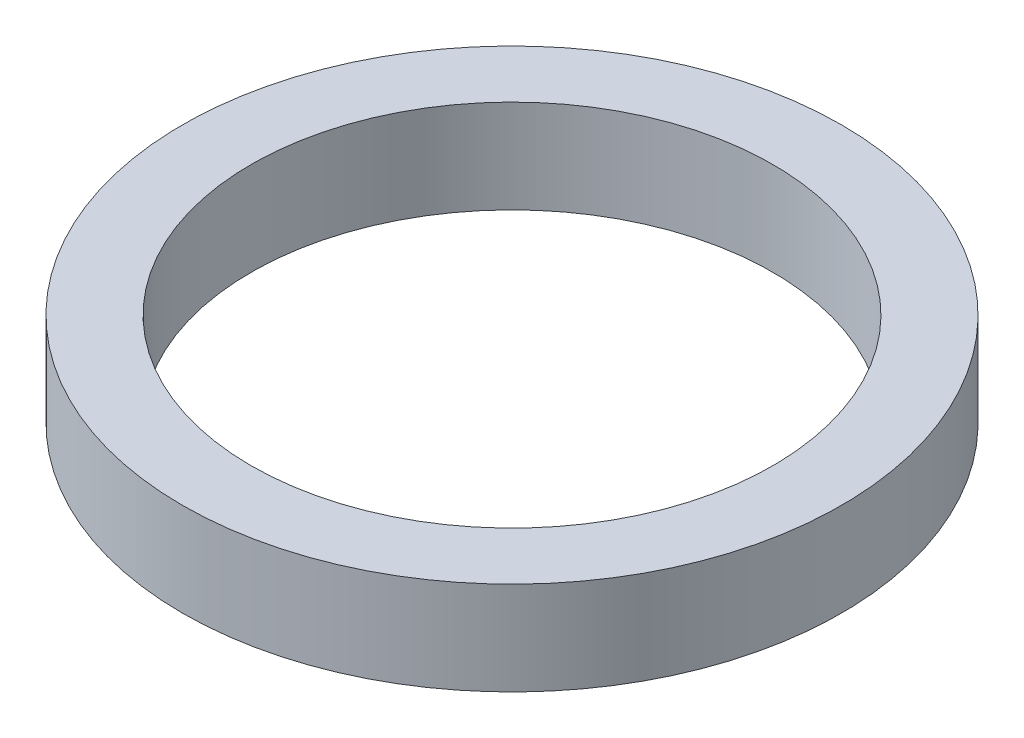
ISO-10303-21;
HEADER;
FILE_DESCRIPTION(('STEP AP214'),'2;1');
FILE_NAME('part.step','',(''),(''),'','','');
FILE_SCHEMA(('AUTOMOTIVE_DESIGN { 1 0 10303 214 1 1 1 1 }'));
ENDSEC;
DATA;
#1=APPLICATION_CONTEXT('core data for automotive mechanical design processes');
#2=APPLICATION_PROTOCOL_DEFINITION('international standard','automotive_design',2000,#1);
#3=PRODUCT_CONTEXT('',#1,'mechanical');
#4=PRODUCT('Part','Part','',(#3));
#5=PRODUCT_RELATED_PRODUCT_CATEGORY('part','',(#4));
#6=PRODUCT_DEFINITION_FORMATION('','',#4);
#7=PRODUCT_DEFINITION_CONTEXT('part definition',#1,'design');
#8=PRODUCT_DEFINITION('design','',#6,#7);
#9=PRODUCT_DEFINITION_SHAPE('','',#8);
#10=(LENGTH_UNIT() NAMED_UNIT(*) SI_UNIT(.MILLI.,.METRE.));
#11=(NAMED_UNIT(*) PLANE_ANGLE_UNIT() SI_UNIT($,.RADIAN.));
#12=(NAMED_UNIT(*) SI_UNIT($,.STERADIAN.) SOLID_ANGLE_UNIT());
#13=UNCERTAINTY_MEASURE_WITH_UNIT(LENGTH_MEASURE(1.E-05),#10,'distance_accuracy_value','');
#14=(GEOMETRIC_REPRESENTATION_CONTEXT(3) GLOBAL_UNCERTAINTY_ASSIGNED_CONTEXT((#13)) GLOBAL_UNIT_ASSIGNED_CONTEXT((#10,
#11,#12)) REPRESENTATION_CONTEXT('',''));
#15=CARTESIAN_POINT('',(0.,0.,0.));
#16=DIRECTION('',(0.,0.,1.));
#17=DIRECTION('',(1.,0.,0.));
#18=AXIS2_PLACEMENT_3D('',#15,#16,#17);
#19=CARTESIAN_POINT('',(0.,17.,0.));
#20=DIRECTION('',(0.,-1.,0.));
#21=DIRECTION('',(0.,0.,-1.));
#22=AXIS2_PLACEMENT_3D('',#19,#20,#21);
#23=CYLINDRICAL_SURFACE('',#22,60.);
#24=CARTESIAN_POINT('',(0.,17.,0.));
#25=DIRECTION('',(0.,1.,0.));
#26=DIRECTION('',(0.,0.,1.));
#27=AXIS2_PLACEMENT_3D('',#24,#25,#26);
#28=CIRCLE('',#27,60.);
#29=CARTESIAN_POINT('',(0.,17.,60.));
#30=VERTEX_POINT('',#29);
#31=EDGE_CURVE('E10',#30,#30,#28,.T.);
#32=ORIENTED_EDGE('',*,*,#31,.F.);
#33=EDGE_LOOP('',(#32));
#34=FACE_BOUND('',#33,.T.);
#35=CARTESIAN_POINT('',(0.,0.,0.));
#36=DIRECTION('',(0.,1.,0.));
#37=DIRECTION('',(0.,0.,1.));
#38=AXIS2_PLACEMENT_3D('',#35,#36,#37);
#39=CIRCLE('',#38,60.);
#40=CARTESIAN_POINT('',(0.,0.,60.));
#41=VERTEX_POINT('',#40);
#42=EDGE_CURVE('E37',#41,#41,#39,.T.);
#43=ORIENTED_EDGE('',*,*,#42,.T.);
#44=EDGE_LOOP('',(#43));
#45=FACE_BOUND('',#44,.T.);
#46=ADVANCED_FACE('F40',(#34,#45),#23,.T.);
#47=CARTESIAN_POINT('',(0.,17.,0.));
#48=DIRECTION('',(0.,1.,0.));
#49=DIRECTION('',(0.,0.,1.));
#50=AXIS2_PLACEMENT_3D('',#47,#48,#49);
#51=PLANE('',#50);
#52=CARTESIAN_POINT('',(0.,17.,0.));
#53=DIRECTION('',(0.,1.,0.));
#54=DIRECTION('',(0.,0.,1.));
#55=AXIS2_PLACEMENT_3D('',#52,#53,#54);
#56=CIRCLE('',#55,47.5);
#57=CARTESIAN_POINT('',(0.,17.,47.5));
#58=VERTEX_POINT('',#57);
#59=EDGE_CURVE('E50',#58,#58,#56,.T.);
#60=ORIENTED_EDGE('',*,*,#59,.F.);
#61=EDGE_LOOP('',(#60));
#62=FACE_BOUND('',#61,.T.);
#63=ORIENTED_EDGE('',*,*,#31,.T.);
#64=EDGE_LOOP('',(#63));
#65=FACE_BOUND('',#64,.T.);
#66=ADVANCED_FACE('F59',(#62,#65),#51,.T.);
#67=CARTESIAN_POINT('',(0.,0.,0.));
#68=DIRECTION('',(0.,1.,0.));
#69=DIRECTION('',(0.,0.,1.));
#70=AXIS2_PLACEMENT_3D('',#67,#68,#69);
#71=PLANE('',#70);
#72=CARTESIAN_POINT('',(0.,0.,0.));
#73=DIRECTION('',(0.,1.,0.));
#74=DIRECTION('',(0.,0.,1.));
#75=AXIS2_PLACEMENT_3D('',#72,#73,#74);
#76=CIRCLE('',#75,47.5);
#77=CARTESIAN_POINT('',(0.,0.,47.5));
#78=VERTEX_POINT('',#77);
#79=EDGE_CURVE('E47',#78,#78,#76,.T.);
#80=ORIENTED_EDGE('',*,*,#79,.T.);
#81=EDGE_LOOP('',(#80));
#82=FACE_BOUND('',#81,.T.);
#83=ORIENTED_EDGE('',*,*,#42,.F.);
#84=EDGE_LOOP('',(#83));
#85=FACE_BOUND('',#84,.T.);
#86=ADVANCED_FACE('F58',(#82,#85),#71,.F.);
#87=CARTESIAN_POINT('',(0.,17.,0.));
#88=DIRECTION('',(0.,-1.,0.));
#89=DIRECTION('',(0.,0.,-1.));
#90=AXIS2_PLACEMENT_3D('',#87,#88,#89);
#91=CYLINDRICAL_SURFACE('',#90,47.5);
#92=ORIENTED_EDGE('',*,*,#59,.T.);
#93=EDGE_LOOP('',(#92));
#94=FACE_BOUND('',#93,.T.);
#95=ORIENTED_EDGE('',*,*,#79,.F.);
#96=EDGE_LOOP('',(#95));
#97=FACE_BOUND('',#96,.T.);
#98=ADVANCED_FACE('F54',(#94,#97),#91,.F.);
#99=CLOSED_SHELL('',(#46,#66,#86,#98));
#100=MANIFOLD_SOLID_BREP('B2',#99);
#101=ADVANCED_BREP_SHAPE_REPRESENTATION('',(#18,#100),#14);
#102=SHAPE_DEFINITION_REPRESENTATION(#9,#101);
ENDSEC;
END-ISO-10303-21;
